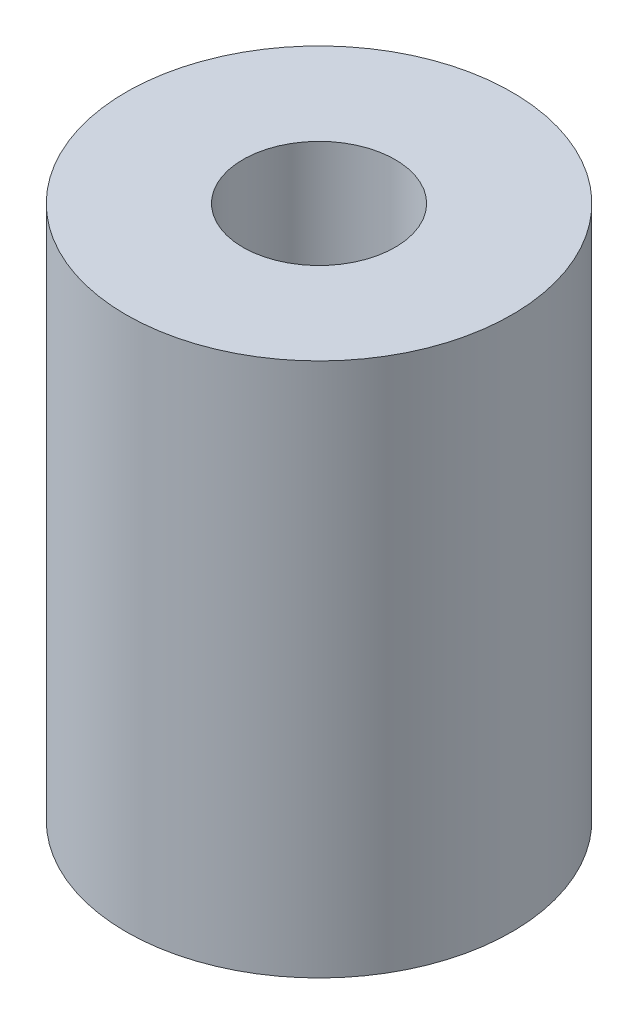
ISO-10303-21;
HEADER;
FILE_DESCRIPTION(('STEP AP214'),'2;1');
FILE_NAME('part.step','',(''),(''),'','','');
FILE_SCHEMA(('AUTOMOTIVE_DESIGN { 1 0 10303 214 1 1 1 1 }'));
ENDSEC;
DATA;
#1=APPLICATION_CONTEXT('core data for automotive mechanical design processes');
#2=APPLICATION_PROTOCOL_DEFINITION('international standard','automotive_design',2000,#1);
#3=PRODUCT_CONTEXT('',#1,'mechanical');
#4=PRODUCT('Part','Part','',(#3));
#5=PRODUCT_RELATED_PRODUCT_CATEGORY('part','',(#4));
#6=PRODUCT_DEFINITION_FORMATION('','',#4);
#7=PRODUCT_DEFINITION_CONTEXT('part definition',#1,'design');
#8=PRODUCT_DEFINITION('design','',#6,#7);
#9=PRODUCT_DEFINITION_SHAPE('','',#8);
#10=(LENGTH_UNIT() NAMED_UNIT(*) SI_UNIT(.MILLI.,.METRE.));
#11=(NAMED_UNIT(*) PLANE_ANGLE_UNIT() SI_UNIT($,.RADIAN.));
#12=(NAMED_UNIT(*) SI_UNIT($,.STERADIAN.) SOLID_ANGLE_UNIT());
#13=UNCERTAINTY_MEASURE_WITH_UNIT(LENGTH_MEASURE(1.E-05),#10,'distance_accuracy_value','');
#14=(GEOMETRIC_REPRESENTATION_CONTEXT(3) GLOBAL_UNCERTAINTY_ASSIGNED_CONTEXT((#13)) GLOBAL_UNIT_ASSIGNED_CONTEXT((#10,
#11,#12)) REPRESENTATION_CONTEXT('',''));
#15=CARTESIAN_POINT('',(0.,0.,0.));
#16=DIRECTION('',(0.,0.,1.));
#17=DIRECTION('',(1.,0.,0.));
#18=AXIS2_PLACEMENT_3D('',#15,#16,#17);
#19=CARTESIAN_POINT('',(0.,11.15,0.));
#20=DIRECTION('',(0.,-1.,0.));
#21=DIRECTION('',(0.,0.,-1.));
#22=AXIS2_PLACEMENT_3D('',#19,#20,#21);
#23=CYLINDRICAL_SURFACE('',#22,8.05);
#24=CARTESIAN_POINT('',(0.,11.15,0.));
#25=DIRECTION('',(0.,1.,0.));
#26=DIRECTION('',(0.,0.,1.));
#27=AXIS2_PLACEMENT_3D('',#24,#25,#26);
#28=CIRCLE('',#27,8.05);
#29=CARTESIAN_POINT('',(0.,11.15,8.05));
#30=VERTEX_POINT('',#29);
#31=EDGE_CURVE('E10',#30,#30,#28,.T.);
#32=ORIENTED_EDGE('',*,*,#31,.F.);
#33=EDGE_LOOP('',(#32));
#34=FACE_BOUND('',#33,.T.);
#35=CARTESIAN_POINT('',(0.,-11.15,0.));
#36=DIRECTION('',(0.,1.,0.));
#37=DIRECTION('',(0.,0.,1.));
#38=AXIS2_PLACEMENT_3D('',#35,#36,#37);
#39=CIRCLE('',#38,8.05);
#40=CARTESIAN_POINT('',(0.,-11.15,8.05));
#41=VERTEX_POINT('',#40);
#42=EDGE_CURVE('E40',#41,#41,#39,.T.);
#43=ORIENTED_EDGE('',*,*,#42,.T.);
#44=EDGE_LOOP('',(#43));
#45=FACE_BOUND('',#44,.T.);
#46=ADVANCED_FACE('F37',(#34,#45),#23,.T.);
#47=CARTESIAN_POINT('',(0.,11.15,0.));
#48=DIRECTION('',(0.,1.,0.));
#49=DIRECTION('',(0.,0.,1.));
#50=AXIS2_PLACEMENT_3D('',#47,#48,#49);
#51=PLANE('',#50);
#52=CARTESIAN_POINT('',(0.,11.15,0.));
#53=DIRECTION('',(0.,1.,0.));
#54=DIRECTION('',(0.,0.,1.));
#55=AXIS2_PLACEMENT_3D('',#52,#53,#54);
#56=CIRCLE('',#55,3.175);
#57=CARTESIAN_POINT('',(0.,11.15,3.175));
#58=VERTEX_POINT('',#57);
#59=EDGE_CURVE('E51',#58,#58,#56,.T.);
#60=ORIENTED_EDGE('',*,*,#59,.F.);
#61=EDGE_LOOP('',(#60));
#62=FACE_BOUND('',#61,.T.);
#63=ORIENTED_EDGE('',*,*,#31,.T.);
#64=EDGE_LOOP('',(#63));
#65=FACE_BOUND('',#64,.T.);
#66=ADVANCED_FACE('F80',(#62,#65),#51,.T.);
#67=CARTESIAN_POINT('',(0.,-11.15,0.));
#68=DIRECTION('',(0.,1.,0.));
#69=DIRECTION('',(0.,0.,1.));
#70=AXIS2_PLACEMENT_3D('',#67,#68,#69);
#71=PLANE('',#70);
#72=CARTESIAN_POINT('',(0.,-11.15,0.));
#73=DIRECTION('',(0.,-1.,0.));
#74=DIRECTION('',(0.,0.,-1.));
#75=AXIS2_PLACEMENT_3D('',#72,#73,#74);
#76=CIRCLE('',#75,2.54);
#77=CARTESIAN_POINT('',(0.,-11.15,-2.54));
#78=VERTEX_POINT('',#77);
#79=EDGE_CURVE('E59',#78,#78,#76,.T.);
#80=ORIENTED_EDGE('',*,*,#79,.F.);
#81=EDGE_LOOP('',(#80));
#82=FACE_BOUND('',#81,.T.);
#83=ORIENTED_EDGE('',*,*,#42,.F.);
#84=EDGE_LOOP('',(#83));
#85=FACE_BOUND('',#84,.T.);
#86=ADVANCED_FACE('F76',(#82,#85),#71,.F.);
#87=CARTESIAN_POINT('',(0.,3.75,0.));
#88=DIRECTION('',(0.,1.,0.));
#89=DIRECTION('',(0.,0.,1.));
#90=AXIS2_PLACEMENT_3D('',#87,#88,#89);
#91=CYLINDRICAL_SURFACE('',#90,3.175);
#92=CARTESIAN_POINT('',(0.,3.75,0.));
#93=DIRECTION('',(0.,1.,0.));
#94=DIRECTION('',(0.,0.,1.));
#95=AXIS2_PLACEMENT_3D('',#92,#93,#94);
#96=CIRCLE('',#95,3.175);
#97=CARTESIAN_POINT('',(0.,3.75,3.175));
#98=VERTEX_POINT('',#97);
#99=EDGE_CURVE('E49',#98,#98,#96,.T.);
#100=ORIENTED_EDGE('',*,*,#99,.F.);
#101=EDGE_LOOP('',(#100));
#102=FACE_BOUND('',#101,.T.);
#103=ORIENTED_EDGE('',*,*,#59,.T.);
#104=EDGE_LOOP('',(#103));
#105=FACE_BOUND('',#104,.T.);
#106=ADVANCED_FACE('F79',(#102,#105),#91,.F.);
#107=CARTESIAN_POINT('',(0.,3.75,0.));
#108=DIRECTION('',(0.,1.,0.));
#109=DIRECTION('',(0.,0.,1.));
#110=AXIS2_PLACEMENT_3D('',#107,#108,#109);
#111=PLANE('',#110);
#112=ORIENTED_EDGE('',*,*,#99,.T.);
#113=EDGE_LOOP('',(#112));
#114=FACE_BOUND('',#113,.T.);
#115=ADVANCED_FACE('F72',(#114),#111,.T.);
#116=CARTESIAN_POINT('',(0.,-3.75,0.));
#117=DIRECTION('',(0.,-1.,0.));
#118=DIRECTION('',(0.,0.,-1.));
#119=AXIS2_PLACEMENT_3D('',#116,#117,#118);
#120=CYLINDRICAL_SURFACE('',#119,2.54);
#121=CARTESIAN_POINT('',(0.,-3.75,0.));
#122=DIRECTION('',(0.,-1.,0.));
#123=DIRECTION('',(0.,0.,-1.));
#124=AXIS2_PLACEMENT_3D('',#121,#122,#123);
#125=CIRCLE('',#124,2.54);
#126=CARTESIAN_POINT('',(0.,-3.75,-2.54));
#127=VERTEX_POINT('',#126);
#128=EDGE_CURVE('E55',#127,#127,#125,.T.);
#129=ORIENTED_EDGE('',*,*,#128,.F.);
#130=EDGE_LOOP('',(#129));
#131=FACE_BOUND('',#130,.T.);
#132=ORIENTED_EDGE('',*,*,#79,.T.);
#133=EDGE_LOOP('',(#132));
#134=FACE_BOUND('',#133,.T.);
#135=ADVANCED_FACE('F69',(#131,#134),#120,.F.);
#136=CARTESIAN_POINT('',(0.,-3.75,0.));
#137=DIRECTION('',(0.,-1.,0.));
#138=DIRECTION('',(0.,0.,-1.));
#139=AXIS2_PLACEMENT_3D('',#136,#137,#138);
#140=PLANE('',#139);
#141=ORIENTED_EDGE('',*,*,#128,.T.);
#142=EDGE_LOOP('',(#141));
#143=FACE_BOUND('',#142,.T.);
#144=ADVANCED_FACE('F67',(#143),#140,.T.);
#145=CLOSED_SHELL('',(#46,#66,#86,#106,#115,#135,#144));
#146=MANIFOLD_SOLID_BREP('B2',#145);
#147=ADVANCED_BREP_SHAPE_REPRESENTATION('',(#18,#146),#14);
#148=SHAPE_DEFINITION_REPRESENTATION(#9,#147);
ENDSEC;
END-ISO-10303-21;
